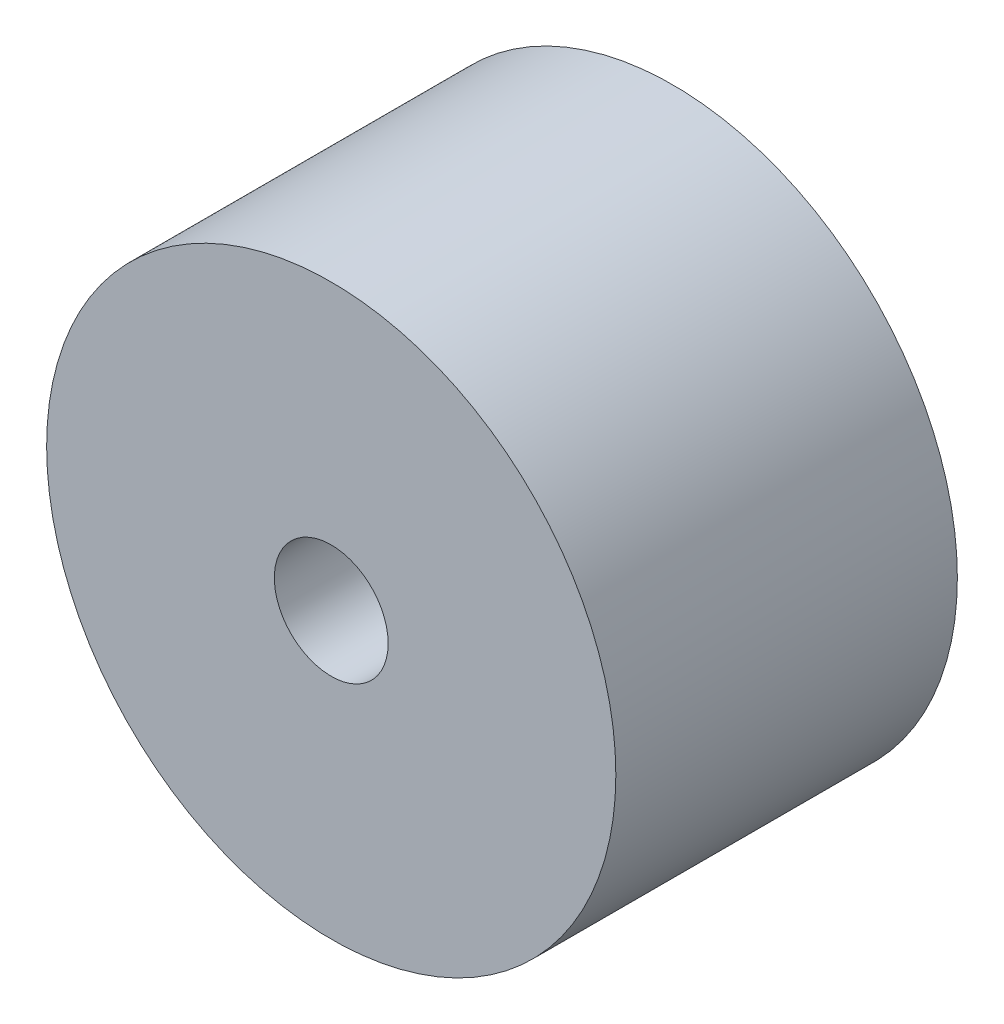
ISO-10303-21;
HEADER;
FILE_DESCRIPTION(('STEP AP214'),'2;1');
FILE_NAME('part.step','',(''),(''),'','','');
FILE_SCHEMA(('AUTOMOTIVE_DESIGN { 1 0 10303 214 1 1 1 1 }'));
ENDSEC;
DATA;
#1=APPLICATION_CONTEXT('core data for automotive mechanical design processes');
#2=APPLICATION_PROTOCOL_DEFINITION('international standard','automotive_design',2000,#1);
#3=PRODUCT_CONTEXT('',#1,'mechanical');
#4=PRODUCT('Part','Part','',(#3));
#5=PRODUCT_RELATED_PRODUCT_CATEGORY('part','',(#4));
#6=PRODUCT_DEFINITION_FORMATION('','',#4);
#7=PRODUCT_DEFINITION_CONTEXT('part definition',#1,'design');
#8=PRODUCT_DEFINITION('design','',#6,#7);
#9=PRODUCT_DEFINITION_SHAPE('','',#8);
#10=(LENGTH_UNIT() NAMED_UNIT(*) SI_UNIT(.MILLI.,.METRE.));
#11=(NAMED_UNIT(*) PLANE_ANGLE_UNIT() SI_UNIT($,.RADIAN.));
#12=(NAMED_UNIT(*) SI_UNIT($,.STERADIAN.) SOLID_ANGLE_UNIT());
#13=UNCERTAINTY_MEASURE_WITH_UNIT(LENGTH_MEASURE(1.E-05),#10,'distance_accuracy_value','');
#14=(GEOMETRIC_REPRESENTATION_CONTEXT(3) GLOBAL_UNCERTAINTY_ASSIGNED_CONTEXT((#13)) GLOBAL_UNIT_ASSIGNED_CONTEXT((#10,
#11,#12)) REPRESENTATION_CONTEXT('',''));
#15=CARTESIAN_POINT('',(0.,0.,0.));
#16=DIRECTION('',(0.,0.,1.));
#17=DIRECTION('',(1.,0.,0.));
#18=AXIS2_PLACEMENT_3D('',#15,#16,#17);
#19=CARTESIAN_POINT('',(0.,0.,3.));
#20=DIRECTION('',(0.,0.,1.));
#21=DIRECTION('',(1.,0.,0.));
#22=AXIS2_PLACEMENT_3D('',#19,#20,#21);
#23=PLANE('',#22);
#24=CARTESIAN_POINT('',(0.,0.,3.));
#25=DIRECTION('',(0.,0.,1.));
#26=DIRECTION('',(1.,0.,0.));
#27=AXIS2_PLACEMENT_3D('',#24,#25,#26);
#28=CIRCLE('',#27,2.5);
#29=CARTESIAN_POINT('',(2.50000000000002,0.,3.));
#30=VERTEX_POINT('',#29);
#31=EDGE_CURVE('E10',#30,#30,#28,.T.);
#32=ORIENTED_EDGE('',*,*,#31,.T.);
#33=EDGE_LOOP('',(#32));
#34=FACE_BOUND('',#33,.T.);
#35=CARTESIAN_POINT('',(0.,0.,3.));
#36=DIRECTION('',(0.,0.,1.));
#37=DIRECTION('',(1.,0.,0.));
#38=AXIS2_PLACEMENT_3D('',#35,#36,#37);
#39=CIRCLE('',#38,0.5);
#40=CARTESIAN_POINT('',(0.500000000000018,0.,3.));
#41=VERTEX_POINT('',#40);
#42=EDGE_CURVE('E41',#41,#41,#39,.T.);
#43=ORIENTED_EDGE('',*,*,#42,.F.);
#44=EDGE_LOOP('',(#43));
#45=FACE_BOUND('',#44,.T.);
#46=ADVANCED_FACE('F30',(#34,#45),#23,.T.);
#47=CARTESIAN_POINT('',(0.,0.,0.));
#48=DIRECTION('',(0.,0.,1.));
#49=DIRECTION('',(1.,0.,0.));
#50=AXIS2_PLACEMENT_3D('',#47,#48,#49);
#51=PLANE('',#50);
#52=CARTESIAN_POINT('',(0.,0.,0.));
#53=DIRECTION('',(0.,0.,1.));
#54=DIRECTION('',(1.,0.,0.));
#55=AXIS2_PLACEMENT_3D('',#52,#53,#54);
#56=CIRCLE('',#55,2.5);
#57=CARTESIAN_POINT('',(2.5,0.,0.));
#58=VERTEX_POINT('',#57);
#59=EDGE_CURVE('E37',#58,#58,#56,.T.);
#60=ORIENTED_EDGE('',*,*,#59,.F.);
#61=EDGE_LOOP('',(#60));
#62=FACE_BOUND('',#61,.T.);
#63=CARTESIAN_POINT('',(0.,0.,0.));
#64=DIRECTION('',(0.,0.,1.));
#65=DIRECTION('',(1.,0.,0.));
#66=AXIS2_PLACEMENT_3D('',#63,#64,#65);
#67=CIRCLE('',#66,0.5);
#68=CARTESIAN_POINT('',(0.5,0.,0.));
#69=VERTEX_POINT('',#68);
#70=EDGE_CURVE('E45',#69,#69,#67,.T.);
#71=ORIENTED_EDGE('',*,*,#70,.T.);
#72=EDGE_LOOP('',(#71));
#73=FACE_BOUND('',#72,.T.);
#74=ADVANCED_FACE('F51',(#62,#73),#51,.F.);
#75=CARTESIAN_POINT('',(0.,0.,3.));
#76=DIRECTION('',(0.,0.,-1.));
#77=DIRECTION('',(-1.,0.,0.));
#78=AXIS2_PLACEMENT_3D('',#75,#76,#77);
#79=CYLINDRICAL_SURFACE('',#78,2.5);
#80=ORIENTED_EDGE('',*,*,#31,.F.);
#81=EDGE_LOOP('',(#80));
#82=FACE_BOUND('',#81,.T.);
#83=ORIENTED_EDGE('',*,*,#59,.T.);
#84=EDGE_LOOP('',(#83));
#85=FACE_BOUND('',#84,.T.);
#86=ADVANCED_FACE('F32',(#82,#85),#79,.T.);
#87=CARTESIAN_POINT('',(0.,0.,3.));
#88=DIRECTION('',(0.,0.,-1.));
#89=DIRECTION('',(-1.,0.,0.));
#90=AXIS2_PLACEMENT_3D('',#87,#88,#89);
#91=CYLINDRICAL_SURFACE('',#90,0.5);
#92=ORIENTED_EDGE('',*,*,#42,.T.);
#93=EDGE_LOOP('',(#92));
#94=FACE_BOUND('',#93,.T.);
#95=ORIENTED_EDGE('',*,*,#70,.F.);
#96=EDGE_LOOP('',(#95));
#97=FACE_BOUND('',#96,.T.);
#98=ADVANCED_FACE('F53',(#94,#97),#91,.F.);
#99=CLOSED_SHELL('',(#46,#74,#86,#98));
#100=MANIFOLD_SOLID_BREP('B2',#99);
#101=ADVANCED_BREP_SHAPE_REPRESENTATION('',(#18,#100),#14);
#102=SHAPE_DEFINITION_REPRESENTATION(#9,#101);
ENDSEC;
END-ISO-10303-21;
